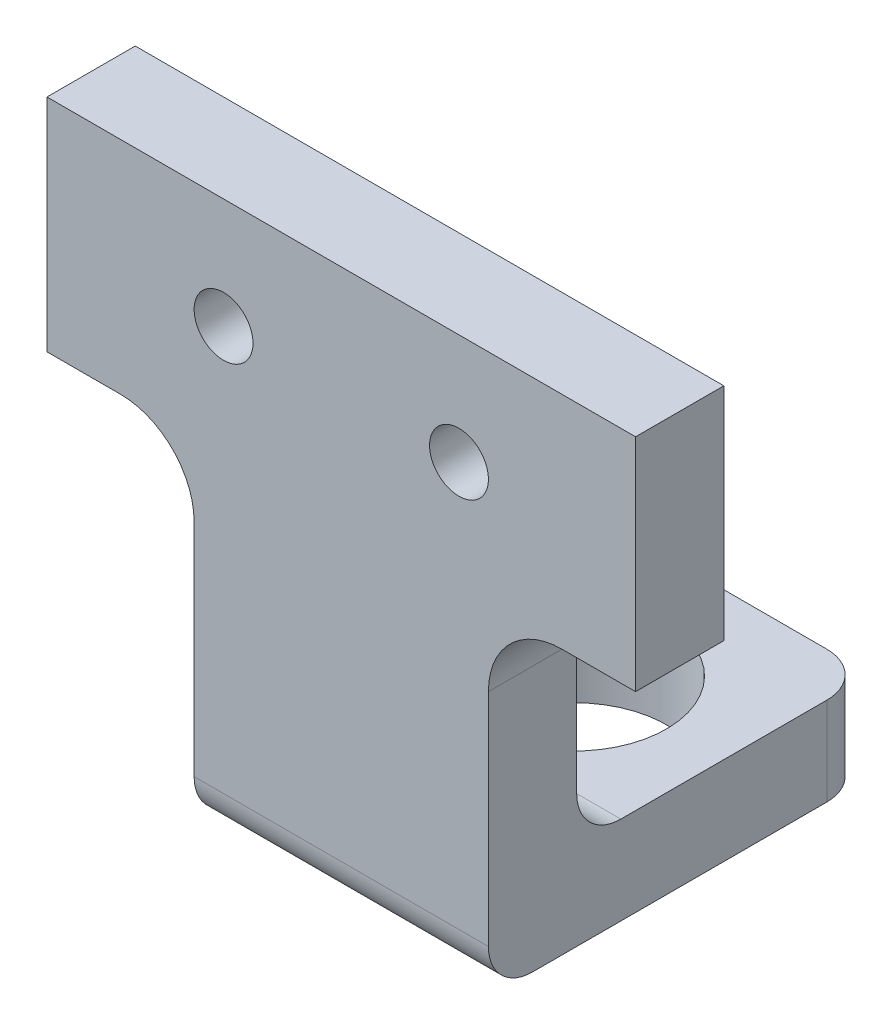
ISO-10303-21;
HEADER;
FILE_DESCRIPTION(('STEP AP214'),'2;1');
FILE_NAME('part.step','',(''),(''),'','','');
FILE_SCHEMA(('AUTOMOTIVE_DESIGN { 1 0 10303 214 1 1 1 1 }'));
ENDSEC;
DATA;
#1=APPLICATION_CONTEXT('core data for automotive mechanical design processes');
#2=APPLICATION_PROTOCOL_DEFINITION('international standard','automotive_design',2000,#1);
#3=PRODUCT_CONTEXT('',#1,'mechanical');
#4=PRODUCT('Part','Part','',(#3));
#5=PRODUCT_RELATED_PRODUCT_CATEGORY('part','',(#4));
#6=PRODUCT_DEFINITION_FORMATION('','',#4);
#7=PRODUCT_DEFINITION_CONTEXT('part definition',#1,'design');
#8=PRODUCT_DEFINITION('design','',#6,#7);
#9=PRODUCT_DEFINITION_SHAPE('','',#8);
#10=(LENGTH_UNIT() NAMED_UNIT(*) SI_UNIT(.MILLI.,.METRE.));
#11=(NAMED_UNIT(*) PLANE_ANGLE_UNIT() SI_UNIT($,.RADIAN.));
#12=(NAMED_UNIT(*) SI_UNIT($,.STERADIAN.) SOLID_ANGLE_UNIT());
#13=UNCERTAINTY_MEASURE_WITH_UNIT(LENGTH_MEASURE(1.E-05),#10,'distance_accuracy_value','');
#14=(GEOMETRIC_REPRESENTATION_CONTEXT(3) GLOBAL_UNCERTAINTY_ASSIGNED_CONTEXT((#13)) GLOBAL_UNIT_ASSIGNED_CONTEXT((#10,
#11,#12)) REPRESENTATION_CONTEXT('',''));
#15=CARTESIAN_POINT('',(0.,0.,0.));
#16=DIRECTION('',(0.,0.,1.));
#17=DIRECTION('',(1.,0.,0.));
#18=AXIS2_PLACEMENT_3D('',#15,#16,#17);
#19=CARTESIAN_POINT('',(-15.,50.,0.));
#20=DIRECTION('',(0.,0.,1.));
#21=DIRECTION('',(1.,0.,0.));
#22=AXIS2_PLACEMENT_3D('',#19,#20,#21);
#23=PLANE('',#22);
#24=CARTESIAN_POINT('',(8.,62.5,0.));
#25=DIRECTION('',(0.,0.,1.));
#26=DIRECTION('',(1.,0.,0.));
#27=AXIS2_PLACEMENT_3D('',#24,#25,#26);
#28=CIRCLE('',#27,2.);
#29=CARTESIAN_POINT('',(10.,62.5,0.));
#30=VERTEX_POINT('',#29);
#31=EDGE_CURVE('E564',#30,#30,#28,.T.);
#32=ORIENTED_EDGE('',*,*,#31,.T.);
#33=EDGE_LOOP('',(#32));
#34=FACE_BOUND('',#33,.T.);
#35=CARTESIAN_POINT('',(-8.,62.5,0.));
#36=DIRECTION('',(0.,0.,1.));
#37=DIRECTION('',(1.,0.,0.));
#38=AXIS2_PLACEMENT_3D('',#35,#36,#37);
#39=CIRCLE('',#38,2.00000000000001);
#40=CARTESIAN_POINT('',(-6.,62.5,0.));
#41=VERTEX_POINT('',#40);
#42=EDGE_CURVE('E574',#41,#41,#39,.T.);
#43=ORIENTED_EDGE('',*,*,#42,.T.);
#44=EDGE_LOOP('',(#43));
#45=FACE_BOUND('',#44,.T.);
#46=DIRECTION('',(0.,-1.,0.));
#47=VECTOR('',#46,1.);
#48=CARTESIAN_POINT('',(9.99999999999999,50.,0.));
#49=LINE('',#48,#47);
#50=CARTESIAN_POINT('',(9.99999999999999,50.,0.));
#51=VERTEX_POINT('',#50);
#52=CARTESIAN_POINT('',(9.99999999999999,41.,0.));
#53=VERTEX_POINT('',#52);
#54=EDGE_CURVE('E310',#51,#53,#49,.T.);
#55=ORIENTED_EDGE('',*,*,#54,.T.);
#56=DIRECTION('',(1.,0.,0.));
#57=VECTOR('',#56,1.);
#58=CARTESIAN_POINT('',(-10.,41.,0.));
#59=LINE('',#58,#57);
#60=CARTESIAN_POINT('',(-10.,41.,0.));
#61=VERTEX_POINT('',#60);
#62=EDGE_CURVE('E267',#53,#61,#59,.F.);
#63=ORIENTED_EDGE('',*,*,#62,.T.);
#64=DIRECTION('',(0.,-1.,0.));
#65=VECTOR('',#64,1.);
#66=CARTESIAN_POINT('',(-10.,50.,0.));
#67=LINE('',#66,#65);
#68=CARTESIAN_POINT('',(-10.,50.,0.));
#69=VERTEX_POINT('',#68);
#70=EDGE_CURVE('E307',#69,#61,#67,.T.);
#71=ORIENTED_EDGE('',*,*,#70,.F.);
#72=CARTESIAN_POINT('',(-15.,50.,0.));
#73=DIRECTION('',(0.,0.,1.));
#74=DIRECTION('',(1.,0.,0.));
#75=AXIS2_PLACEMENT_3D('',#72,#73,#74);
#76=CIRCLE('',#75,5.);
#77=CARTESIAN_POINT('',(-15.,55.,0.));
#78=VERTEX_POINT('',#77);
#79=EDGE_CURVE('E304',#69,#78,#76,.T.);
#80=ORIENTED_EDGE('',*,*,#79,.T.);
#81=DIRECTION('',(1.,0.,0.));
#82=VECTOR('',#81,1.);
#83=CARTESIAN_POINT('',(-20.,55.,0.));
#84=LINE('',#83,#82);
#85=CARTESIAN_POINT('',(-20.,55.,0.));
#86=VERTEX_POINT('',#85);
#87=EDGE_CURVE('E301',#86,#78,#84,.T.);
#88=ORIENTED_EDGE('',*,*,#87,.F.);
#89=DIRECTION('',(0.,-1.,0.));
#90=VECTOR('',#89,1.);
#91=CARTESIAN_POINT('',(-20.,70.,0.));
#92=LINE('',#91,#90);
#93=CARTESIAN_POINT('',(-20.,70.,0.));
#94=VERTEX_POINT('',#93);
#95=EDGE_CURVE('E238',#94,#86,#92,.T.);
#96=ORIENTED_EDGE('',*,*,#95,.F.);
#97=DIRECTION('',(1.,0.,0.));
#98=VECTOR('',#97,1.);
#99=CARTESIAN_POINT('',(-20.,70.,0.));
#100=LINE('',#99,#98);
#101=CARTESIAN_POINT('',(20.,70.,0.));
#102=VERTEX_POINT('',#101);
#103=EDGE_CURVE('E234',#94,#102,#100,.T.);
#104=ORIENTED_EDGE('',*,*,#103,.T.);
#105=DIRECTION('',(0.,-1.,0.));
#106=VECTOR('',#105,1.);
#107=CARTESIAN_POINT('',(20.,70.,0.));
#108=LINE('',#107,#106);
#109=CARTESIAN_POINT('',(20.,55.,0.));
#110=VERTEX_POINT('',#109);
#111=EDGE_CURVE('E318',#102,#110,#108,.T.);
#112=ORIENTED_EDGE('',*,*,#111,.T.);
#113=DIRECTION('',(1.,0.,0.));
#114=VECTOR('',#113,1.);
#115=CARTESIAN_POINT('',(15.,55.,0.));
#116=LINE('',#115,#114);
#117=CARTESIAN_POINT('',(15.,55.,0.));
#118=VERTEX_POINT('',#117);
#119=EDGE_CURVE('E315',#118,#110,#116,.T.);
#120=ORIENTED_EDGE('',*,*,#119,.F.);
#121=CARTESIAN_POINT('',(15.,50.,0.));
#122=DIRECTION('',(0.,0.,-1.));
#123=DIRECTION('',(-1.,0.,0.));
#124=AXIS2_PLACEMENT_3D('',#121,#122,#123);
#125=CIRCLE('',#124,5.);
#126=EDGE_CURVE('E313',#51,#118,#125,.T.);
#127=ORIENTED_EDGE('',*,*,#126,.F.);
#128=EDGE_LOOP('',(#55,#63,#71,#80,#88,#96,#104,#112,#120,#127));
#129=FACE_BOUND('',#128,.T.);
#130=ADVANCED_FACE('F100',(#34,#45,#129),#23,.F.);
#131=CARTESIAN_POINT('',(-15.,50.,6.));
#132=DIRECTION('',(0.,0.,1.));
#133=DIRECTION('',(1.,0.,0.));
#134=AXIS2_PLACEMENT_3D('',#131,#132,#133);
#135=PLANE('',#134);
#136=CARTESIAN_POINT('',(-8.,62.5,6.));
#137=DIRECTION('',(0.,0.,1.));
#138=DIRECTION('',(1.,0.,0.));
#139=AXIS2_PLACEMENT_3D('',#136,#137,#138);
#140=CIRCLE('',#139,2.00000000000001);
#141=CARTESIAN_POINT('',(-6.,62.5,6.));
#142=VERTEX_POINT('',#141);
#143=EDGE_CURVE('E302',#142,#142,#140,.T.);
#144=ORIENTED_EDGE('',*,*,#143,.F.);
#145=EDGE_LOOP('',(#144));
#146=FACE_BOUND('',#145,.T.);
#147=DIRECTION('',(0.,-1.,0.));
#148=VECTOR('',#147,1.);
#149=CARTESIAN_POINT('',(-10.,50.,6.));
#150=LINE('',#149,#148);
#151=CARTESIAN_POINT('',(-10.,50.,6.));
#152=VERTEX_POINT('',#151);
#153=CARTESIAN_POINT('',(-10.,35.,6.));
#154=VERTEX_POINT('',#153);
#155=EDGE_CURVE('E280',#152,#154,#150,.T.);
#156=ORIENTED_EDGE('',*,*,#155,.T.);
#157=DIRECTION('',(1.,0.,0.));
#158=VECTOR('',#157,1.);
#159=CARTESIAN_POINT('',(9.99999999999999,35.,6.));
#160=LINE('',#159,#158);
#161=CARTESIAN_POINT('',(10.,35.,6.));
#162=VERTEX_POINT('',#161);
#163=EDGE_CURVE('E273',#154,#162,#160,.T.);
#164=ORIENTED_EDGE('',*,*,#163,.T.);
#165=DIRECTION('',(0.,-1.,0.));
#166=VECTOR('',#165,1.);
#167=CARTESIAN_POINT('',(9.99999999999999,50.,6.));
#168=LINE('',#167,#166);
#169=CARTESIAN_POINT('',(9.99999999999999,50.,6.));
#170=VERTEX_POINT('',#169);
#171=EDGE_CURVE('E278',#170,#162,#168,.T.);
#172=ORIENTED_EDGE('',*,*,#171,.F.);
#173=CARTESIAN_POINT('',(15.,50.,6.));
#174=DIRECTION('',(0.,0.,-1.));
#175=DIRECTION('',(-1.,0.,0.));
#176=AXIS2_PLACEMENT_3D('',#173,#174,#175);
#177=CIRCLE('',#176,5.);
#178=CARTESIAN_POINT('',(15.,55.,6.));
#179=VERTEX_POINT('',#178);
#180=EDGE_CURVE('E287',#170,#179,#177,.T.);
#181=ORIENTED_EDGE('',*,*,#180,.T.);
#182=DIRECTION('',(1.,0.,0.));
#183=VECTOR('',#182,1.);
#184=CARTESIAN_POINT('',(15.,55.,6.));
#185=LINE('',#184,#183);
#186=CARTESIAN_POINT('',(20.,55.,6.));
#187=VERTEX_POINT('',#186);
#188=EDGE_CURVE('E289',#179,#187,#185,.T.);
#189=ORIENTED_EDGE('',*,*,#188,.T.);
#190=DIRECTION('',(0.,-1.,0.));
#191=VECTOR('',#190,1.);
#192=CARTESIAN_POINT('',(20.,70.,6.));
#193=LINE('',#192,#191);
#194=CARTESIAN_POINT('',(20.,70.,6.));
#195=VERTEX_POINT('',#194);
#196=EDGE_CURVE('E295',#195,#187,#193,.T.);
#197=ORIENTED_EDGE('',*,*,#196,.F.);
#198=DIRECTION('',(1.,0.,0.));
#199=VECTOR('',#198,1.);
#200=CARTESIAN_POINT('',(-20.,70.,6.));
#201=LINE('',#200,#199);
#202=CARTESIAN_POINT('',(-20.,70.,6.));
#203=VERTEX_POINT('',#202);
#204=EDGE_CURVE('E232',#203,#195,#201,.T.);
#205=ORIENTED_EDGE('',*,*,#204,.F.);
#206=DIRECTION('',(0.,-1.,0.));
#207=VECTOR('',#206,1.);
#208=CARTESIAN_POINT('',(-20.,70.,6.));
#209=LINE('',#208,#207);
#210=CARTESIAN_POINT('',(-20.,55.,6.));
#211=VERTEX_POINT('',#210);
#212=EDGE_CURVE('E223',#203,#211,#209,.T.);
#213=ORIENTED_EDGE('',*,*,#212,.T.);
#214=DIRECTION('',(1.,0.,0.));
#215=VECTOR('',#214,1.);
#216=CARTESIAN_POINT('',(-20.,55.,6.));
#217=LINE('',#216,#215);
#218=CARTESIAN_POINT('',(-15.,55.,6.));
#219=VERTEX_POINT('',#218);
#220=EDGE_CURVE('E211',#211,#219,#217,.T.);
#221=ORIENTED_EDGE('',*,*,#220,.T.);
#222=CARTESIAN_POINT('',(-15.,50.,6.));
#223=DIRECTION('',(0.,0.,1.));
#224=DIRECTION('',(1.,0.,0.));
#225=AXIS2_PLACEMENT_3D('',#222,#223,#224);
#226=CIRCLE('',#225,5.);
#227=EDGE_CURVE('E222',#152,#219,#226,.T.);
#228=ORIENTED_EDGE('',*,*,#227,.F.);
#229=EDGE_LOOP('',(#156,#164,#172,#181,#189,#197,#205,#213,#221,#228));
#230=FACE_BOUND('',#229,.T.);
#231=CARTESIAN_POINT('',(8.,62.5,6.));
#232=DIRECTION('',(0.,0.,1.));
#233=DIRECTION('',(1.,0.,0.));
#234=AXIS2_PLACEMENT_3D('',#231,#232,#233);
#235=CIRCLE('',#234,2.);
#236=CARTESIAN_POINT('',(10.,62.5,6.));
#237=VERTEX_POINT('',#236);
#238=EDGE_CURVE('E567',#237,#237,#235,.T.);
#239=ORIENTED_EDGE('',*,*,#238,.F.);
#240=EDGE_LOOP('',(#239));
#241=FACE_BOUND('',#240,.T.);
#242=ADVANCED_FACE('F228',(#146,#230,#241),#135,.T.);
#243=CARTESIAN_POINT('',(-20.,70.,6.));
#244=DIRECTION('',(1.,0.,0.));
#245=DIRECTION('',(0.,1.,0.));
#246=AXIS2_PLACEMENT_3D('',#243,#244,#245);
#247=PLANE('',#246);
#248=ORIENTED_EDGE('',*,*,#95,.T.);
#249=DIRECTION('',(0.,0.,-1.));
#250=VECTOR('',#249,1.);
#251=CARTESIAN_POINT('',(-20.,55.,6.));
#252=LINE('',#251,#250);
#253=EDGE_CURVE('E216',#211,#86,#252,.T.);
#254=ORIENTED_EDGE('',*,*,#253,.F.);
#255=ORIENTED_EDGE('',*,*,#212,.F.);
#256=DIRECTION('',(0.,0.,-1.));
#257=VECTOR('',#256,1.);
#258=CARTESIAN_POINT('',(-20.,70.,6.));
#259=LINE('',#258,#257);
#260=EDGE_CURVE('E299',#203,#94,#259,.T.);
#261=ORIENTED_EDGE('',*,*,#260,.T.);
#262=EDGE_LOOP('',(#248,#254,#255,#261));
#263=FACE_BOUND('',#262,.T.);
#264=ADVANCED_FACE('F236',(#263),#247,.F.);
#265=CARTESIAN_POINT('',(-20.,55.,6.));
#266=DIRECTION('',(0.,1.,0.));
#267=DIRECTION('',(0.,0.,1.));
#268=AXIS2_PLACEMENT_3D('',#265,#266,#267);
#269=PLANE('',#268);
#270=ORIENTED_EDGE('',*,*,#87,.T.);
#271=DIRECTION('',(0.,0.,-1.));
#272=VECTOR('',#271,1.);
#273=CARTESIAN_POINT('',(-15.,55.,6.));
#274=LINE('',#273,#272);
#275=EDGE_CURVE('E218',#219,#78,#274,.T.);
#276=ORIENTED_EDGE('',*,*,#275,.F.);
#277=ORIENTED_EDGE('',*,*,#220,.F.);
#278=ORIENTED_EDGE('',*,*,#253,.T.);
#279=EDGE_LOOP('',(#270,#276,#277,#278));
#280=FACE_BOUND('',#279,.T.);
#281=ADVANCED_FACE('F214',(#280),#269,.F.);
#282=CARTESIAN_POINT('',(-15.,50.,6.));
#283=DIRECTION('',(0.,0.,-1.));
#284=DIRECTION('',(-1.,0.,0.));
#285=AXIS2_PLACEMENT_3D('',#282,#283,#284);
#286=CYLINDRICAL_SURFACE('',#285,5.);
#287=ORIENTED_EDGE('',*,*,#79,.F.);
#288=DIRECTION('',(0.,0.,-1.));
#289=VECTOR('',#288,1.);
#290=CARTESIAN_POINT('',(-10.,50.,6.));
#291=LINE('',#290,#289);
#292=EDGE_CURVE('E244',#152,#69,#291,.T.);
#293=ORIENTED_EDGE('',*,*,#292,.F.);
#294=ORIENTED_EDGE('',*,*,#227,.T.);
#295=ORIENTED_EDGE('',*,*,#275,.T.);
#296=EDGE_LOOP('',(#287,#293,#294,#295));
#297=FACE_BOUND('',#296,.T.);
#298=ADVANCED_FACE('F343',(#297),#286,.F.);
#299=CARTESIAN_POINT('',(-10.,50.,6.));
#300=DIRECTION('',(1.,0.,0.));
#301=DIRECTION('',(0.,1.,0.));
#302=AXIS2_PLACEMENT_3D('',#299,#300,#301);
#303=PLANE('',#302);
#304=DIRECTION('',(0.,0.,-1.));
#305=VECTOR('',#304,1.);
#306=CARTESIAN_POINT('',(-10.,32.,6.));
#307=LINE('',#306,#305);
#308=CARTESIAN_POINT('',(-10.,32.,3.));
#309=VERTEX_POINT('',#308);
#310=CARTESIAN_POINT('',(-10.,32.,-17.));
#311=VERTEX_POINT('',#310);
#312=EDGE_CURVE('E334',#309,#311,#307,.T.);
#313=ORIENTED_EDGE('',*,*,#312,.F.);
#314=CARTESIAN_POINT('',(-10.,35.,3.));
#315=DIRECTION('',(1.,0.,0.));
#316=DIRECTION('',(0.,1.,0.));
#317=AXIS2_PLACEMENT_3D('',#314,#315,#316);
#318=CIRCLE('',#317,3.);
#319=EDGE_CURVE('E12',#309,#154,#318,.F.);
#320=ORIENTED_EDGE('',*,*,#319,.T.);
#321=ORIENTED_EDGE('',*,*,#155,.F.);
#322=ORIENTED_EDGE('',*,*,#292,.T.);
#323=ORIENTED_EDGE('',*,*,#70,.T.);
#324=CARTESIAN_POINT('',(-10.,41.,-3.));
#325=DIRECTION('',(1.,0.,0.));
#326=DIRECTION('',(0.,1.,0.));
#327=AXIS2_PLACEMENT_3D('',#324,#325,#326);
#328=CIRCLE('',#327,3.);
#329=CARTESIAN_POINT('',(-10.,38.,-3.));
#330=VERTEX_POINT('',#329);
#331=EDGE_CURVE('E271',#61,#330,#328,.T.);
#332=ORIENTED_EDGE('',*,*,#331,.T.);
#333=DIRECTION('',(0.,0.,1.));
#334=VECTOR('',#333,1.);
#335=CARTESIAN_POINT('',(-10.,38.,-20.));
#336=LINE('',#335,#334);
#337=CARTESIAN_POINT('',(-10.,38.,-17.));
#338=VERTEX_POINT('',#337);
#339=EDGE_CURVE('E562',#338,#330,#336,.T.);
#340=ORIENTED_EDGE('',*,*,#339,.F.);
#341=DIRECTION('',(0.,1.,0.));
#342=VECTOR('',#341,1.);
#343=CARTESIAN_POINT('',(-10.,50.,-17.));
#344=LINE('',#343,#342);
#345=EDGE_CURVE('E261',#338,#311,#344,.F.);
#346=ORIENTED_EDGE('',*,*,#345,.T.);
#347=EDGE_LOOP('',(#313,#320,#321,#322,#323,#332,#340,#346));
#348=FACE_BOUND('',#347,.T.);
#349=ADVANCED_FACE('F337',(#348),#303,.F.);
#350=CARTESIAN_POINT('',(-10.,32.,6.));
#351=DIRECTION('',(0.,1.,0.));
#352=DIRECTION('',(0.,0.,1.));
#353=AXIS2_PLACEMENT_3D('',#350,#351,#352);
#354=PLANE('',#353);
#355=CARTESIAN_POINT('',(0.,32.,-9.85));
#356=DIRECTION('',(0.,1.,0.));
#357=DIRECTION('',(0.,0.,1.));
#358=AXIS2_PLACEMENT_3D('',#355,#356,#357);
#359=CIRCLE('',#358,6.25);
#360=CARTESIAN_POINT('',(0.,32.,-3.6));
#361=VERTEX_POINT('',#360);
#362=EDGE_CURVE('E546',#361,#361,#359,.T.);
#363=ORIENTED_EDGE('',*,*,#362,.T.);
#364=EDGE_LOOP('',(#363));
#365=FACE_BOUND('',#364,.T.);
#366=DIRECTION('',(0.,0.,-1.));
#367=VECTOR('',#366,1.);
#368=CARTESIAN_POINT('',(10.,32.,6.));
#369=LINE('',#368,#367);
#370=CARTESIAN_POINT('',(10.,32.,3.));
#371=VERTEX_POINT('',#370);
#372=CARTESIAN_POINT('',(10.,32.,-17.));
#373=VERTEX_POINT('',#372);
#374=EDGE_CURVE('E332',#371,#373,#369,.T.);
#375=ORIENTED_EDGE('',*,*,#374,.F.);
#376=DIRECTION('',(1.,0.,0.));
#377=VECTOR('',#376,1.);
#378=CARTESIAN_POINT('',(-10.,32.,3.));
#379=LINE('',#378,#377);
#380=EDGE_CURVE('E108',#371,#309,#379,.F.);
#381=ORIENTED_EDGE('',*,*,#380,.T.);
#382=ORIENTED_EDGE('',*,*,#312,.T.);
#383=CARTESIAN_POINT('',(-7.,32.,-17.));
#384=DIRECTION('',(0.,1.,0.));
#385=DIRECTION('',(0.,0.,1.));
#386=AXIS2_PLACEMENT_3D('',#383,#384,#385);
#387=CIRCLE('',#386,3.);
#388=CARTESIAN_POINT('',(-7.,32.,-20.));
#389=VERTEX_POINT('',#388);
#390=EDGE_CURVE('E250',#311,#389,#387,.F.);
#391=ORIENTED_EDGE('',*,*,#390,.T.);
#392=DIRECTION('',(-1.,0.,0.));
#393=VECTOR('',#392,1.);
#394=CARTESIAN_POINT('',(10.,32.,-20.));
#395=LINE('',#394,#393);
#396=CARTESIAN_POINT('',(7.,32.,-20.));
#397=VERTEX_POINT('',#396);
#398=EDGE_CURVE('E553',#397,#389,#395,.T.);
#399=ORIENTED_EDGE('',*,*,#398,.F.);
#400=CARTESIAN_POINT('',(7.,32.,-17.));
#401=DIRECTION('',(0.,1.,0.));
#402=DIRECTION('',(0.,0.,1.));
#403=AXIS2_PLACEMENT_3D('',#400,#401,#402);
#404=CIRCLE('',#403,3.);
#405=EDGE_CURVE('E252',#397,#373,#404,.F.);
#406=ORIENTED_EDGE('',*,*,#405,.T.);
#407=EDGE_LOOP('',(#375,#381,#382,#391,#399,#406));
#408=FACE_BOUND('',#407,.T.);
#409=ADVANCED_FACE('F366',(#365,#408),#354,.F.);
#410=CARTESIAN_POINT('',(9.99999999999999,50.,6.));
#411=DIRECTION('',(1.,0.,0.));
#412=DIRECTION('',(0.,1.,0.));
#413=AXIS2_PLACEMENT_3D('',#410,#411,#412);
#414=PLANE('',#413);
#415=ORIENTED_EDGE('',*,*,#171,.T.);
#416=CARTESIAN_POINT('',(10.,35.,3.));
#417=DIRECTION('',(1.,0.,0.));
#418=DIRECTION('',(0.,1.,0.));
#419=AXIS2_PLACEMENT_3D('',#416,#417,#418);
#420=CIRCLE('',#419,3.);
#421=EDGE_CURVE('E122',#162,#371,#420,.T.);
#422=ORIENTED_EDGE('',*,*,#421,.T.);
#423=ORIENTED_EDGE('',*,*,#374,.T.);
#424=DIRECTION('',(0.,-1.,0.));
#425=VECTOR('',#424,1.);
#426=CARTESIAN_POINT('',(9.99999999999999,38.,-17.));
#427=LINE('',#426,#425);
#428=CARTESIAN_POINT('',(10.,38.,-17.));
#429=VERTEX_POINT('',#428);
#430=EDGE_CURVE('E255',#373,#429,#427,.F.);
#431=ORIENTED_EDGE('',*,*,#430,.T.);
#432=DIRECTION('',(0.,0.,1.));
#433=VECTOR('',#432,1.);
#434=CARTESIAN_POINT('',(10.,38.,-20.));
#435=LINE('',#434,#433);
#436=CARTESIAN_POINT('',(10.,38.,-3.));
#437=VERTEX_POINT('',#436);
#438=EDGE_CURVE('E565',#429,#437,#435,.T.);
#439=ORIENTED_EDGE('',*,*,#438,.T.);
#440=CARTESIAN_POINT('',(9.99999999999999,41.,-3.));
#441=DIRECTION('',(1.,0.,0.));
#442=DIRECTION('',(0.,1.,0.));
#443=AXIS2_PLACEMENT_3D('',#440,#441,#442);
#444=CIRCLE('',#443,3.);
#445=EDGE_CURVE('E269',#437,#53,#444,.F.);
#446=ORIENTED_EDGE('',*,*,#445,.T.);
#447=ORIENTED_EDGE('',*,*,#54,.F.);
#448=DIRECTION('',(0.,0.,-1.));
#449=VECTOR('',#448,1.);
#450=CARTESIAN_POINT('',(9.99999999999999,50.,6.));
#451=LINE('',#450,#449);
#452=EDGE_CURVE('E285',#170,#51,#451,.T.);
#453=ORIENTED_EDGE('',*,*,#452,.F.);
#454=EDGE_LOOP('',(#415,#422,#423,#431,#439,#446,#447,#453));
#455=FACE_BOUND('',#454,.T.);
#456=ADVANCED_FACE('F283',(#455),#414,.T.);
#457=CARTESIAN_POINT('',(15.,50.,6.));
#458=DIRECTION('',(0.,0.,-1.));
#459=DIRECTION('',(-1.,0.,0.));
#460=AXIS2_PLACEMENT_3D('',#457,#458,#459);
#461=CYLINDRICAL_SURFACE('',#460,5.);
#462=ORIENTED_EDGE('',*,*,#126,.T.);
#463=DIRECTION('',(0.,0.,-1.));
#464=VECTOR('',#463,1.);
#465=CARTESIAN_POINT('',(15.,55.,6.));
#466=LINE('',#465,#464);
#467=EDGE_CURVE('E328',#179,#118,#466,.T.);
#468=ORIENTED_EDGE('',*,*,#467,.F.);
#469=ORIENTED_EDGE('',*,*,#180,.F.);
#470=ORIENTED_EDGE('',*,*,#452,.T.);
#471=EDGE_LOOP('',(#462,#468,#469,#470));
#472=FACE_BOUND('',#471,.T.);
#473=ADVANCED_FACE('F358',(#472),#461,.F.);
#474=CARTESIAN_POINT('',(15.,55.,6.));
#475=DIRECTION('',(0.,1.,0.));
#476=DIRECTION('',(0.,0.,1.));
#477=AXIS2_PLACEMENT_3D('',#474,#475,#476);
#478=PLANE('',#477);
#479=ORIENTED_EDGE('',*,*,#119,.T.);
#480=DIRECTION('',(0.,0.,-1.));
#481=VECTOR('',#480,1.);
#482=CARTESIAN_POINT('',(20.,55.,6.));
#483=LINE('',#482,#481);
#484=EDGE_CURVE('E326',#187,#110,#483,.T.);
#485=ORIENTED_EDGE('',*,*,#484,.F.);
#486=ORIENTED_EDGE('',*,*,#188,.F.);
#487=ORIENTED_EDGE('',*,*,#467,.T.);
#488=EDGE_LOOP('',(#479,#485,#486,#487));
#489=FACE_BOUND('',#488,.T.);
#490=ADVANCED_FACE('F354',(#489),#478,.F.);
#491=CARTESIAN_POINT('',(20.,70.,6.));
#492=DIRECTION('',(1.,0.,0.));
#493=DIRECTION('',(0.,1.,0.));
#494=AXIS2_PLACEMENT_3D('',#491,#492,#493);
#495=PLANE('',#494);
#496=ORIENTED_EDGE('',*,*,#111,.F.);
#497=DIRECTION('',(0.,0.,-1.));
#498=VECTOR('',#497,1.);
#499=CARTESIAN_POINT('',(20.,70.,6.));
#500=LINE('',#499,#498);
#501=EDGE_CURVE('E324',#195,#102,#500,.T.);
#502=ORIENTED_EDGE('',*,*,#501,.F.);
#503=ORIENTED_EDGE('',*,*,#196,.T.);
#504=ORIENTED_EDGE('',*,*,#484,.T.);
#505=EDGE_LOOP('',(#496,#502,#503,#504));
#506=FACE_BOUND('',#505,.T.);
#507=ADVANCED_FACE('F349',(#506),#495,.T.);
#508=CARTESIAN_POINT('',(-20.,70.,6.));
#509=DIRECTION('',(0.,1.,0.));
#510=DIRECTION('',(0.,0.,1.));
#511=AXIS2_PLACEMENT_3D('',#508,#509,#510);
#512=PLANE('',#511);
#513=ORIENTED_EDGE('',*,*,#103,.F.);
#514=ORIENTED_EDGE('',*,*,#260,.F.);
#515=ORIENTED_EDGE('',*,*,#204,.T.);
#516=ORIENTED_EDGE('',*,*,#501,.T.);
#517=EDGE_LOOP('',(#513,#514,#515,#516));
#518=FACE_BOUND('',#517,.T.);
#519=ADVANCED_FACE('F346',(#518),#512,.T.);
#520=CARTESIAN_POINT('',(-8.,62.5,6.));
#521=DIRECTION('',(0.,0.,-1.));
#522=DIRECTION('',(-1.,0.,0.));
#523=AXIS2_PLACEMENT_3D('',#520,#521,#522);
#524=CYLINDRICAL_SURFACE('',#523,2.00000000000001);
#525=ORIENTED_EDGE('',*,*,#143,.T.);
#526=EDGE_LOOP('',(#525));
#527=FACE_BOUND('',#526,.T.);
#528=ORIENTED_EDGE('',*,*,#42,.F.);
#529=EDGE_LOOP('',(#528));
#530=FACE_BOUND('',#529,.T.);
#531=ADVANCED_FACE('F382',(#527,#530),#524,.F.);
#532=CARTESIAN_POINT('',(8.,62.5,6.));
#533=DIRECTION('',(0.,0.,-1.));
#534=DIRECTION('',(-1.,0.,0.));
#535=AXIS2_PLACEMENT_3D('',#532,#533,#534);
#536=CYLINDRICAL_SURFACE('',#535,2.);
#537=ORIENTED_EDGE('',*,*,#238,.T.);
#538=EDGE_LOOP('',(#537));
#539=FACE_BOUND('',#538,.T.);
#540=ORIENTED_EDGE('',*,*,#31,.F.);
#541=EDGE_LOOP('',(#540));
#542=FACE_BOUND('',#541,.T.);
#543=ADVANCED_FACE('F398',(#539,#542),#536,.F.);
#544=CARTESIAN_POINT('',(10.,38.,-20.));
#545=DIRECTION('',(0.,-1.,0.));
#546=DIRECTION('',(0.,0.,-1.));
#547=AXIS2_PLACEMENT_3D('',#544,#545,#546);
#548=PLANE('',#547);
#549=CARTESIAN_POINT('',(0.,38.,-9.85));
#550=DIRECTION('',(0.,1.,0.));
#551=DIRECTION('',(0.,0.,1.));
#552=AXIS2_PLACEMENT_3D('',#549,#550,#551);
#553=CIRCLE('',#552,6.25);
#554=CARTESIAN_POINT('',(0.,38.,-3.6));
#555=VERTEX_POINT('',#554);
#556=EDGE_CURVE('E586',#555,#555,#553,.T.);
#557=ORIENTED_EDGE('',*,*,#556,.F.);
#558=EDGE_LOOP('',(#557));
#559=FACE_BOUND('',#558,.T.);
#560=ORIENTED_EDGE('',*,*,#339,.T.);
#561=DIRECTION('',(1.,0.,0.));
#562=VECTOR('',#561,1.);
#563=CARTESIAN_POINT('',(10.,38.,-3.));
#564=LINE('',#563,#562);
#565=EDGE_CURVE('E264',#330,#437,#564,.T.);
#566=ORIENTED_EDGE('',*,*,#565,.T.);
#567=ORIENTED_EDGE('',*,*,#438,.F.);
#568=CARTESIAN_POINT('',(7.,38.,-17.));
#569=DIRECTION('',(0.,-1.,0.));
#570=DIRECTION('',(0.,0.,-1.));
#571=AXIS2_PLACEMENT_3D('',#568,#569,#570);
#572=CIRCLE('',#571,3.);
#573=CARTESIAN_POINT('',(7.,38.,-20.));
#574=VERTEX_POINT('',#573);
#575=EDGE_CURVE('E259',#429,#574,#572,.F.);
#576=ORIENTED_EDGE('',*,*,#575,.T.);
#577=DIRECTION('',(1.,0.,0.));
#578=VECTOR('',#577,1.);
#579=CARTESIAN_POINT('',(10.,38.,-20.));
#580=LINE('',#579,#578);
#581=CARTESIAN_POINT('',(-7.,38.,-20.));
#582=VERTEX_POINT('',#581);
#583=EDGE_CURVE('E558',#582,#574,#580,.T.);
#584=ORIENTED_EDGE('',*,*,#583,.F.);
#585=CARTESIAN_POINT('',(-7.,38.,-17.));
#586=DIRECTION('',(0.,-1.,0.));
#587=DIRECTION('',(0.,0.,-1.));
#588=AXIS2_PLACEMENT_3D('',#585,#586,#587);
#589=CIRCLE('',#588,3.);
#590=EDGE_CURVE('E257',#582,#338,#589,.F.);
#591=ORIENTED_EDGE('',*,*,#590,.T.);
#592=EDGE_LOOP('',(#560,#566,#567,#576,#584,#591));
#593=FACE_BOUND('',#592,.T.);
#594=ADVANCED_FACE('F405',(#559,#593),#548,.F.);
#595=CARTESIAN_POINT('',(0.,0.,-20.));
#596=DIRECTION('',(0.,0.,1.));
#597=DIRECTION('',(1.,0.,0.));
#598=AXIS2_PLACEMENT_3D('',#595,#596,#597);
#599=PLANE('',#598);
#600=ORIENTED_EDGE('',*,*,#583,.T.);
#601=DIRECTION('',(0.,-1.,0.));
#602=VECTOR('',#601,1.);
#603=CARTESIAN_POINT('',(7.,32.,-20.));
#604=LINE('',#603,#602);
#605=EDGE_CURVE('E242',#574,#397,#604,.T.);
#606=ORIENTED_EDGE('',*,*,#605,.T.);
#607=ORIENTED_EDGE('',*,*,#398,.T.);
#608=DIRECTION('',(0.,1.,0.));
#609=VECTOR('',#608,1.);
#610=CARTESIAN_POINT('',(-7.,0.,-20.));
#611=LINE('',#610,#609);
#612=EDGE_CURVE('E239',#389,#582,#611,.T.);
#613=ORIENTED_EDGE('',*,*,#612,.T.);
#614=EDGE_LOOP('',(#600,#606,#607,#613));
#615=FACE_BOUND('',#614,.T.);
#616=ADVANCED_FACE('F414',(#615),#599,.F.);
#617=CARTESIAN_POINT('',(0.,32.,-9.85));
#618=DIRECTION('',(0.,1.,0.));
#619=DIRECTION('',(0.,0.,1.));
#620=AXIS2_PLACEMENT_3D('',#617,#618,#619);
#621=CYLINDRICAL_SURFACE('',#620,6.25);
#622=ORIENTED_EDGE('',*,*,#362,.F.);
#623=EDGE_LOOP('',(#622));
#624=FACE_BOUND('',#623,.T.);
#625=ORIENTED_EDGE('',*,*,#556,.T.);
#626=EDGE_LOOP('',(#625));
#627=FACE_BOUND('',#626,.T.);
#628=ADVANCED_FACE('F423',(#624,#627),#621,.F.);
#629=CARTESIAN_POINT('',(7.,0.,-17.));
#630=DIRECTION('',(0.,1.,0.));
#631=DIRECTION('',(-1.,0.,0.));
#632=AXIS2_PLACEMENT_3D('',#629,#630,#631);
#633=CYLINDRICAL_SURFACE('',#632,3.);
#634=ORIENTED_EDGE('',*,*,#575,.F.);
#635=ORIENTED_EDGE('',*,*,#430,.F.);
#636=ORIENTED_EDGE('',*,*,#405,.F.);
#637=ORIENTED_EDGE('',*,*,#605,.F.);
#638=EDGE_LOOP('',(#634,#635,#636,#637));
#639=FACE_BOUND('',#638,.T.);
#640=ADVANCED_FACE('F431',(#639),#633,.T.);
#641=CARTESIAN_POINT('',(-7.,0.,-17.));
#642=DIRECTION('',(0.,1.,0.));
#643=DIRECTION('',(-1.,0.,0.));
#644=AXIS2_PLACEMENT_3D('',#641,#642,#643);
#645=CYLINDRICAL_SURFACE('',#644,3.);
#646=ORIENTED_EDGE('',*,*,#390,.F.);
#647=ORIENTED_EDGE('',*,*,#345,.F.);
#648=ORIENTED_EDGE('',*,*,#590,.F.);
#649=ORIENTED_EDGE('',*,*,#612,.F.);
#650=EDGE_LOOP('',(#646,#647,#648,#649));
#651=FACE_BOUND('',#650,.T.);
#652=ADVANCED_FACE('F438',(#651),#645,.T.);
#653=CARTESIAN_POINT('',(10.,41.,-3.));
#654=DIRECTION('',(-1.,0.,0.));
#655=DIRECTION('',(0.,0.,1.));
#656=AXIS2_PLACEMENT_3D('',#653,#654,#655);
#657=CYLINDRICAL_SURFACE('',#656,3.);
#658=ORIENTED_EDGE('',*,*,#331,.F.);
#659=ORIENTED_EDGE('',*,*,#62,.F.);
#660=ORIENTED_EDGE('',*,*,#445,.F.);
#661=ORIENTED_EDGE('',*,*,#565,.F.);
#662=EDGE_LOOP('',(#658,#659,#660,#661));
#663=FACE_BOUND('',#662,.T.);
#664=ADVANCED_FACE('F446',(#663),#657,.F.);
#665=CARTESIAN_POINT('',(-15.,35.,3.));
#666=DIRECTION('',(-1.,0.,0.));
#667=DIRECTION('',(0.,0.,1.));
#668=AXIS2_PLACEMENT_3D('',#665,#666,#667);
#669=CYLINDRICAL_SURFACE('',#668,3.);
#670=ORIENTED_EDGE('',*,*,#319,.F.);
#671=ORIENTED_EDGE('',*,*,#380,.F.);
#672=ORIENTED_EDGE('',*,*,#421,.F.);
#673=ORIENTED_EDGE('',*,*,#163,.F.);
#674=EDGE_LOOP('',(#670,#671,#672,#673));
#675=FACE_BOUND('',#674,.T.);
#676=ADVANCED_FACE('F102',(#675),#669,.T.);
#677=CLOSED_SHELL('',(#130,#242,#264,#281,#298,#349,#409,#456,#473,#490,#507,#519,#531,#543,
#594,#616,#628,#640,#652,#664,#676));
#678=MANIFOLD_SOLID_BREP('B2',#677);
#679=ADVANCED_BREP_SHAPE_REPRESENTATION('',(#18,#678),#14);
#680=SHAPE_DEFINITION_REPRESENTATION(#9,#679);
ENDSEC;
END-ISO-10303-21;
